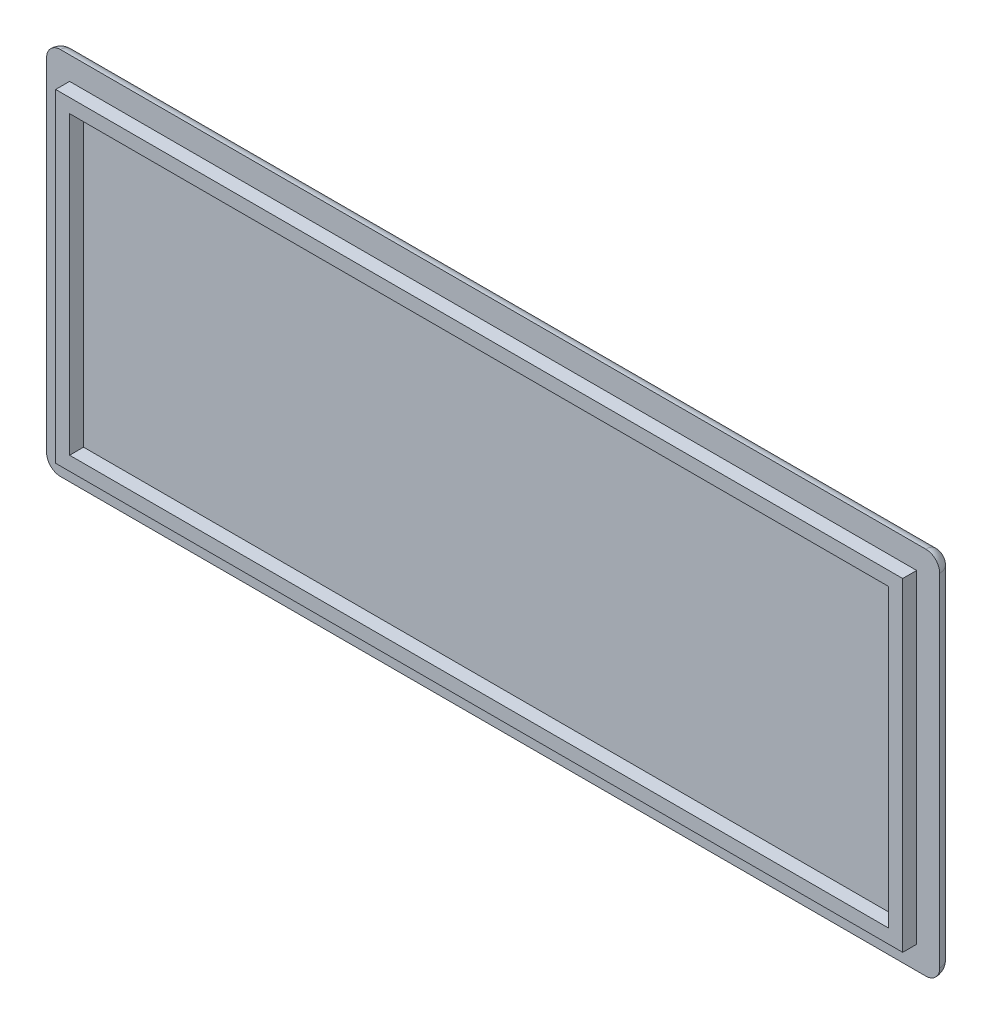
ISO-10303-21;
HEADER;
FILE_DESCRIPTION(('STEP AP214'),'2;1');
FILE_NAME('part.step','',(''),(''),'','','');
FILE_SCHEMA(('AUTOMOTIVE_DESIGN { 1 0 10303 214 1 1 1 1 }'));
ENDSEC;
DATA;
#1=APPLICATION_CONTEXT('core data for automotive mechanical design processes');
#2=APPLICATION_PROTOCOL_DEFINITION('international standard','automotive_design',2000,#1);
#3=PRODUCT_CONTEXT('',#1,'mechanical');
#4=PRODUCT('Part','Part','',(#3));
#5=PRODUCT_RELATED_PRODUCT_CATEGORY('part','',(#4));
#6=PRODUCT_DEFINITION_FORMATION('','',#4);
#7=PRODUCT_DEFINITION_CONTEXT('part definition',#1,'design');
#8=PRODUCT_DEFINITION('design','',#6,#7);
#9=PRODUCT_DEFINITION_SHAPE('','',#8);
#10=(LENGTH_UNIT() NAMED_UNIT(*) SI_UNIT(.MILLI.,.METRE.));
#11=(NAMED_UNIT(*) PLANE_ANGLE_UNIT() SI_UNIT($,.RADIAN.));
#12=(NAMED_UNIT(*) SI_UNIT($,.STERADIAN.) SOLID_ANGLE_UNIT());
#13=UNCERTAINTY_MEASURE_WITH_UNIT(LENGTH_MEASURE(1.E-05),#10,'distance_accuracy_value','');
#14=(GEOMETRIC_REPRESENTATION_CONTEXT(3) GLOBAL_UNCERTAINTY_ASSIGNED_CONTEXT((#13)) GLOBAL_UNIT_ASSIGNED_CONTEXT((#10,
#11,#12)) REPRESENTATION_CONTEXT('',''));
#15=CARTESIAN_POINT('',(0.,0.,0.));
#16=DIRECTION('',(0.,0.,1.));
#17=DIRECTION('',(1.,0.,0.));
#18=AXIS2_PLACEMENT_3D('',#15,#16,#17);
#19=CARTESIAN_POINT('',(1.,25.5,1.));
#20=DIRECTION('',(0.,0.,1.));
#21=DIRECTION('',(1.,0.,0.));
#22=AXIS2_PLACEMENT_3D('',#19,#20,#21);
#23=SPHERICAL_SURFACE('',#22,1.);
#24=CARTESIAN_POINT('',(1.,25.5,1.));
#25=DIRECTION('',(-1.,0.,0.));
#26=DIRECTION('',(0.,0.,1.));
#27=AXIS2_PLACEMENT_3D('',#24,#25,#26);
#28=CIRCLE('',#27,1.);
#29=CARTESIAN_POINT('',(1.,25.5,0.));
#30=VERTEX_POINT('',#29);
#31=CARTESIAN_POINT('',(1.,26.5,1.));
#32=VERTEX_POINT('',#31);
#33=EDGE_CURVE('E250',#30,#32,#28,.F.);
#34=ORIENTED_EDGE('',*,*,#33,.F.);
#35=CARTESIAN_POINT('',(1.,25.5,1.));
#36=DIRECTION('',(0.,-1.,0.));
#37=DIRECTION('',(0.,0.,-1.));
#38=AXIS2_PLACEMENT_3D('',#35,#36,#37);
#39=CIRCLE('',#38,1.);
#40=CARTESIAN_POINT('',(0.,25.5,1.));
#41=VERTEX_POINT('',#40);
#42=EDGE_CURVE('E40',#41,#30,#39,.T.);
#43=ORIENTED_EDGE('',*,*,#42,.F.);
#44=CARTESIAN_POINT('',(1.,25.5,1.));
#45=DIRECTION('',(0.,0.,-1.));
#46=DIRECTION('',(-1.,0.,0.));
#47=AXIS2_PLACEMENT_3D('',#44,#45,#46);
#48=CIRCLE('',#47,1.);
#49=EDGE_CURVE('E11',#32,#41,#48,.F.);
#50=ORIENTED_EDGE('',*,*,#49,.F.);
#51=EDGE_LOOP('',(#34,#43,#50));
#52=FACE_BOUND('',#51,.T.);
#53=ADVANCED_FACE('F33',(#52),#23,.T.);
#54=CARTESIAN_POINT('',(63.,1.,1.));
#55=DIRECTION('',(0.,0.,1.));
#56=DIRECTION('',(1.,0.,0.));
#57=AXIS2_PLACEMENT_3D('',#54,#55,#56);
#58=SPHERICAL_SURFACE('',#57,1.);
#59=CARTESIAN_POINT('',(63.,1.,1.));
#60=DIRECTION('',(0.,1.,0.));
#61=DIRECTION('',(0.,0.,1.));
#62=AXIS2_PLACEMENT_3D('',#59,#60,#61);
#63=CIRCLE('',#62,1.);
#64=CARTESIAN_POINT('',(64.,1.,1.));
#65=VERTEX_POINT('',#64);
#66=CARTESIAN_POINT('',(63.,1.,0.));
#67=VERTEX_POINT('',#66);
#68=EDGE_CURVE('E242',#65,#67,#63,.T.);
#69=ORIENTED_EDGE('',*,*,#68,.F.);
#70=CARTESIAN_POINT('',(63.,1.,1.));
#71=DIRECTION('',(0.,0.,-1.));
#72=DIRECTION('',(-1.,0.,0.));
#73=AXIS2_PLACEMENT_3D('',#70,#71,#72);
#74=CIRCLE('',#73,1.);
#75=CARTESIAN_POINT('',(63.,0.,1.));
#76=VERTEX_POINT('',#75);
#77=EDGE_CURVE('E248',#76,#65,#74,.F.);
#78=ORIENTED_EDGE('',*,*,#77,.F.);
#79=CARTESIAN_POINT('',(63.,1.,1.));
#80=DIRECTION('',(1.,0.,0.));
#81=DIRECTION('',(0.,0.,-1.));
#82=AXIS2_PLACEMENT_3D('',#79,#80,#81);
#83=CIRCLE('',#82,1.);
#84=EDGE_CURVE('E245',#67,#76,#83,.F.);
#85=ORIENTED_EDGE('',*,*,#84,.F.);
#86=EDGE_LOOP('',(#69,#78,#85));
#87=FACE_BOUND('',#86,.T.);
#88=ADVANCED_FACE('F281',(#87),#58,.T.);
#89=CARTESIAN_POINT('',(0.,1.,1.));
#90=DIRECTION('',(1.,0.,0.));
#91=DIRECTION('',(0.,0.,-1.));
#92=AXIS2_PLACEMENT_3D('',#89,#90,#91);
#93=CYLINDRICAL_SURFACE('',#92,1.);
#94=DIRECTION('',(-1.,0.,0.));
#95=VECTOR('',#94,1.);
#96=CARTESIAN_POINT('',(0.,1.,0.));
#97=LINE('',#96,#95);
#98=CARTESIAN_POINT('',(1.,1.,0.));
#99=VERTEX_POINT('',#98);
#100=EDGE_CURVE('E228',#67,#99,#97,.T.);
#101=ORIENTED_EDGE('',*,*,#100,.F.);
#102=ORIENTED_EDGE('',*,*,#84,.T.);
#103=DIRECTION('',(1.,0.,0.));
#104=VECTOR('',#103,1.);
#105=CARTESIAN_POINT('',(0.,0.,1.));
#106=LINE('',#105,#104);
#107=CARTESIAN_POINT('',(1.,0.,1.));
#108=VERTEX_POINT('',#107);
#109=EDGE_CURVE('E207',#108,#76,#106,.T.);
#110=ORIENTED_EDGE('',*,*,#109,.F.);
#111=CARTESIAN_POINT('',(1.,1.,1.));
#112=DIRECTION('',(-1.,0.,0.));
#113=DIRECTION('',(0.,0.,1.));
#114=AXIS2_PLACEMENT_3D('',#111,#112,#113);
#115=CIRCLE('',#114,1.);
#116=EDGE_CURVE('E240',#99,#108,#115,.T.);
#117=ORIENTED_EDGE('',*,*,#116,.F.);
#118=EDGE_LOOP('',(#101,#102,#110,#117));
#119=FACE_BOUND('',#118,.T.);
#120=ADVANCED_FACE('F272',(#119),#93,.T.);
#121=CARTESIAN_POINT('',(63.,0.,1.));
#122=DIRECTION('',(0.,1.,0.));
#123=DIRECTION('',(0.,0.,1.));
#124=AXIS2_PLACEMENT_3D('',#121,#122,#123);
#125=CYLINDRICAL_SURFACE('',#124,1.);
#126=DIRECTION('',(0.,1.,0.));
#127=VECTOR('',#126,1.);
#128=CARTESIAN_POINT('',(64.,0.,1.));
#129=LINE('',#128,#127);
#130=CARTESIAN_POINT('',(64.,25.5,1.));
#131=VERTEX_POINT('',#130);
#132=EDGE_CURVE('E210',#65,#131,#129,.T.);
#133=ORIENTED_EDGE('',*,*,#132,.F.);
#134=ORIENTED_EDGE('',*,*,#68,.T.);
#135=DIRECTION('',(0.,-1.,0.));
#136=VECTOR('',#135,1.);
#137=CARTESIAN_POINT('',(63.,0.,0.));
#138=LINE('',#137,#136);
#139=CARTESIAN_POINT('',(63.,25.5,0.));
#140=VERTEX_POINT('',#139);
#141=EDGE_CURVE('E231',#140,#67,#138,.T.);
#142=ORIENTED_EDGE('',*,*,#141,.F.);
#143=CARTESIAN_POINT('',(63.,25.5,1.));
#144=DIRECTION('',(0.,-1.,0.));
#145=DIRECTION('',(0.,0.,-1.));
#146=AXIS2_PLACEMENT_3D('',#143,#144,#145);
#147=CIRCLE('',#146,1.);
#148=EDGE_CURVE('E237',#140,#131,#147,.T.);
#149=ORIENTED_EDGE('',*,*,#148,.T.);
#150=EDGE_LOOP('',(#133,#134,#142,#149));
#151=FACE_BOUND('',#150,.T.);
#152=ADVANCED_FACE('F269',(#151),#125,.T.);
#153=CARTESIAN_POINT('',(63.,25.5,1.));
#154=DIRECTION('',(0.,0.,1.));
#155=DIRECTION('',(1.,0.,0.));
#156=AXIS2_PLACEMENT_3D('',#153,#154,#155);
#157=SPHERICAL_SURFACE('',#156,1.);
#158=ORIENTED_EDGE('',*,*,#148,.F.);
#159=CARTESIAN_POINT('',(63.,25.5,1.));
#160=DIRECTION('',(-1.,0.,0.));
#161=DIRECTION('',(0.,0.,1.));
#162=AXIS2_PLACEMENT_3D('',#159,#160,#161);
#163=CIRCLE('',#162,1.);
#164=CARTESIAN_POINT('',(63.,26.5,1.));
#165=VERTEX_POINT('',#164);
#166=EDGE_CURVE('E220',#165,#140,#163,.T.);
#167=ORIENTED_EDGE('',*,*,#166,.F.);
#168=CARTESIAN_POINT('',(63.,25.5,1.));
#169=DIRECTION('',(0.,0.,-1.));
#170=DIRECTION('',(-1.,0.,0.));
#171=AXIS2_PLACEMENT_3D('',#168,#169,#170);
#172=CIRCLE('',#171,1.);
#173=EDGE_CURVE('E226',#131,#165,#172,.F.);
#174=ORIENTED_EDGE('',*,*,#173,.F.);
#175=EDGE_LOOP('',(#158,#167,#174));
#176=FACE_BOUND('',#175,.T.);
#177=ADVANCED_FACE('F265',(#176),#157,.T.);
#178=CARTESIAN_POINT('',(1.,1.,1.));
#179=DIRECTION('',(0.,0.,1.));
#180=DIRECTION('',(1.,0.,0.));
#181=AXIS2_PLACEMENT_3D('',#178,#179,#180);
#182=SPHERICAL_SURFACE('',#181,1.);
#183=CARTESIAN_POINT('',(1.,1.,1.));
#184=DIRECTION('',(0.,-1.,0.));
#185=DIRECTION('',(0.,0.,-1.));
#186=AXIS2_PLACEMENT_3D('',#183,#184,#185);
#187=CIRCLE('',#186,1.);
#188=CARTESIAN_POINT('',(0.,1.,1.));
#189=VERTEX_POINT('',#188);
#190=EDGE_CURVE('E234',#99,#189,#187,.F.);
#191=ORIENTED_EDGE('',*,*,#190,.F.);
#192=ORIENTED_EDGE('',*,*,#116,.T.);
#193=CARTESIAN_POINT('',(1.,1.,1.));
#194=DIRECTION('',(0.,0.,-1.));
#195=DIRECTION('',(-1.,0.,0.));
#196=AXIS2_PLACEMENT_3D('',#193,#194,#195);
#197=CIRCLE('',#196,1.);
#198=EDGE_CURVE('E223',#189,#108,#197,.F.);
#199=ORIENTED_EDGE('',*,*,#198,.F.);
#200=EDGE_LOOP('',(#191,#192,#199));
#201=FACE_BOUND('',#200,.T.);
#202=ADVANCED_FACE('F277',(#201),#182,.T.);
#203=CARTESIAN_POINT('',(1.,0.,1.));
#204=DIRECTION('',(0.,-1.,0.));
#205=DIRECTION('',(0.,0.,-1.));
#206=AXIS2_PLACEMENT_3D('',#203,#204,#205);
#207=CYLINDRICAL_SURFACE('',#206,1.);
#208=DIRECTION('',(0.,-1.,0.));
#209=VECTOR('',#208,1.);
#210=CARTESIAN_POINT('',(0.,0.,1.));
#211=LINE('',#210,#209);
#212=EDGE_CURVE('E205',#41,#189,#211,.T.);
#213=ORIENTED_EDGE('',*,*,#212,.F.);
#214=ORIENTED_EDGE('',*,*,#42,.T.);
#215=DIRECTION('',(0.,1.,0.));
#216=VECTOR('',#215,1.);
#217=CARTESIAN_POINT('',(1.,0.,0.));
#218=LINE('',#217,#216);
#219=EDGE_CURVE('E217',#99,#30,#218,.T.);
#220=ORIENTED_EDGE('',*,*,#219,.F.);
#221=ORIENTED_EDGE('',*,*,#190,.T.);
#222=EDGE_LOOP('',(#213,#214,#220,#221));
#223=FACE_BOUND('',#222,.T.);
#224=ADVANCED_FACE('F254',(#223),#207,.T.);
#225=CARTESIAN_POINT('',(0.,25.5,1.));
#226=DIRECTION('',(-1.,0.,0.));
#227=DIRECTION('',(0.,0.,1.));
#228=AXIS2_PLACEMENT_3D('',#225,#226,#227);
#229=CYLINDRICAL_SURFACE('',#228,1.);
#230=DIRECTION('',(1.,0.,0.));
#231=VECTOR('',#230,1.);
#232=CARTESIAN_POINT('',(0.,25.5,0.));
#233=LINE('',#232,#231);
#234=EDGE_CURVE('E214',#30,#140,#233,.T.);
#235=ORIENTED_EDGE('',*,*,#234,.F.);
#236=ORIENTED_EDGE('',*,*,#33,.T.);
#237=DIRECTION('',(-1.,0.,0.));
#238=VECTOR('',#237,1.);
#239=CARTESIAN_POINT('',(0.,26.5,1.));
#240=LINE('',#239,#238);
#241=EDGE_CURVE('E212',#165,#32,#240,.T.);
#242=ORIENTED_EDGE('',*,*,#241,.F.);
#243=ORIENTED_EDGE('',*,*,#166,.T.);
#244=EDGE_LOOP('',(#235,#236,#242,#243));
#245=FACE_BOUND('',#244,.T.);
#246=ADVANCED_FACE('F261',(#245),#229,.T.);
#247=CARTESIAN_POINT('',(0.,0.,1.));
#248=DIRECTION('',(0.,0.,-1.));
#249=DIRECTION('',(-1.,0.,0.));
#250=AXIS2_PLACEMENT_3D('',#247,#248,#249);
#251=PLANE('',#250);
#252=ORIENTED_EDGE('',*,*,#241,.T.);
#253=ORIENTED_EDGE('',*,*,#49,.T.);
#254=ORIENTED_EDGE('',*,*,#212,.T.);
#255=ORIENTED_EDGE('',*,*,#198,.T.);
#256=ORIENTED_EDGE('',*,*,#109,.T.);
#257=ORIENTED_EDGE('',*,*,#77,.T.);
#258=ORIENTED_EDGE('',*,*,#132,.T.);
#259=ORIENTED_EDGE('',*,*,#173,.T.);
#260=EDGE_LOOP('',(#252,#253,#254,#255,#256,#257,#258,#259));
#261=FACE_BOUND('',#260,.T.);
#262=DIRECTION('',(0.,-1.,0.));
#263=VECTOR('',#262,1.);
#264=CARTESIAN_POINT('',(1.65,1.65,1.));
#265=LINE('',#264,#263);
#266=CARTESIAN_POINT('',(1.65,24.85,1.));
#267=VERTEX_POINT('',#266);
#268=CARTESIAN_POINT('',(1.65,1.65,1.));
#269=VERTEX_POINT('',#268);
#270=EDGE_CURVE('E169',#267,#269,#265,.T.);
#271=ORIENTED_EDGE('',*,*,#270,.F.);
#272=DIRECTION('',(-1.,0.,0.));
#273=VECTOR('',#272,1.);
#274=CARTESIAN_POINT('',(1.65,24.85,1.));
#275=LINE('',#274,#273);
#276=CARTESIAN_POINT('',(62.35,24.85,1.));
#277=VERTEX_POINT('',#276);
#278=EDGE_CURVE('E177',#277,#267,#275,.T.);
#279=ORIENTED_EDGE('',*,*,#278,.F.);
#280=DIRECTION('',(0.,1.,0.));
#281=VECTOR('',#280,1.);
#282=CARTESIAN_POINT('',(62.35,1.65,1.));
#283=LINE('',#282,#281);
#284=CARTESIAN_POINT('',(62.35,1.65,1.));
#285=VERTEX_POINT('',#284);
#286=EDGE_CURVE('E189',#285,#277,#283,.T.);
#287=ORIENTED_EDGE('',*,*,#286,.F.);
#288=DIRECTION('',(1.,0.,0.));
#289=VECTOR('',#288,1.);
#290=CARTESIAN_POINT('',(1.65,1.65,1.));
#291=LINE('',#290,#289);
#292=EDGE_CURVE('E186',#269,#285,#291,.T.);
#293=ORIENTED_EDGE('',*,*,#292,.F.);
#294=EDGE_LOOP('',(#271,#279,#287,#293));
#295=FACE_BOUND('',#294,.T.);
#296=ADVANCED_FACE('F278',(#261,#295),#251,.F.);
#297=CARTESIAN_POINT('',(0.,0.,0.));
#298=DIRECTION('',(0.,0.,-1.));
#299=DIRECTION('',(-1.,0.,0.));
#300=AXIS2_PLACEMENT_3D('',#297,#298,#299);
#301=PLANE('',#300);
#302=ORIENTED_EDGE('',*,*,#234,.T.);
#303=ORIENTED_EDGE('',*,*,#141,.T.);
#304=ORIENTED_EDGE('',*,*,#100,.T.);
#305=ORIENTED_EDGE('',*,*,#219,.T.);
#306=EDGE_LOOP('',(#302,#303,#304,#305));
#307=FACE_BOUND('',#306,.T.);
#308=ADVANCED_FACE('F259',(#307),#301,.T.);
#309=CARTESIAN_POINT('',(1.65,1.65,2.));
#310=DIRECTION('',(1.,0.,0.));
#311=DIRECTION('',(0.,0.,-1.));
#312=AXIS2_PLACEMENT_3D('',#309,#310,#311);
#313=PLANE('',#312);
#314=ORIENTED_EDGE('',*,*,#270,.T.);
#315=DIRECTION('',(0.,0.,-1.));
#316=VECTOR('',#315,1.);
#317=CARTESIAN_POINT('',(1.65,1.65,2.));
#318=LINE('',#317,#316);
#319=CARTESIAN_POINT('',(1.65,1.65,2.));
#320=VERTEX_POINT('',#319);
#321=EDGE_CURVE('E202',#320,#269,#318,.T.);
#322=ORIENTED_EDGE('',*,*,#321,.F.);
#323=DIRECTION('',(0.,-1.,0.));
#324=VECTOR('',#323,1.);
#325=CARTESIAN_POINT('',(1.65,1.65,2.));
#326=LINE('',#325,#324);
#327=CARTESIAN_POINT('',(1.65,24.85,2.));
#328=VERTEX_POINT('',#327);
#329=EDGE_CURVE('E173',#328,#320,#326,.T.);
#330=ORIENTED_EDGE('',*,*,#329,.F.);
#331=DIRECTION('',(0.,0.,-1.));
#332=VECTOR('',#331,1.);
#333=CARTESIAN_POINT('',(1.65,24.85,2.));
#334=LINE('',#333,#332);
#335=EDGE_CURVE('E183',#328,#267,#334,.T.);
#336=ORIENTED_EDGE('',*,*,#335,.T.);
#337=EDGE_LOOP('',(#314,#322,#330,#336));
#338=FACE_BOUND('',#337,.T.);
#339=ADVANCED_FACE('F301',(#338),#313,.F.);
#340=CARTESIAN_POINT('',(1.65,1.65,2.));
#341=DIRECTION('',(0.,1.,0.));
#342=DIRECTION('',(0.,0.,1.));
#343=AXIS2_PLACEMENT_3D('',#340,#341,#342);
#344=PLANE('',#343);
#345=ORIENTED_EDGE('',*,*,#292,.T.);
#346=DIRECTION('',(0.,0.,-1.));
#347=VECTOR('',#346,1.);
#348=CARTESIAN_POINT('',(62.35,1.65,2.));
#349=LINE('',#348,#347);
#350=CARTESIAN_POINT('',(62.35,1.65,2.));
#351=VERTEX_POINT('',#350);
#352=EDGE_CURVE('E199',#351,#285,#349,.T.);
#353=ORIENTED_EDGE('',*,*,#352,.F.);
#354=DIRECTION('',(1.,0.,0.));
#355=VECTOR('',#354,1.);
#356=CARTESIAN_POINT('',(1.65,1.65,2.));
#357=LINE('',#356,#355);
#358=EDGE_CURVE('E176',#320,#351,#357,.T.);
#359=ORIENTED_EDGE('',*,*,#358,.F.);
#360=ORIENTED_EDGE('',*,*,#321,.T.);
#361=EDGE_LOOP('',(#345,#353,#359,#360));
#362=FACE_BOUND('',#361,.T.);
#363=ADVANCED_FACE('F306',(#362),#344,.F.);
#364=CARTESIAN_POINT('',(62.35,1.65,2.));
#365=DIRECTION('',(-1.,0.,0.));
#366=DIRECTION('',(0.,0.,1.));
#367=AXIS2_PLACEMENT_3D('',#364,#365,#366);
#368=PLANE('',#367);
#369=ORIENTED_EDGE('',*,*,#286,.T.);
#370=DIRECTION('',(0.,0.,-1.));
#371=VECTOR('',#370,1.);
#372=CARTESIAN_POINT('',(62.35,24.85,2.));
#373=LINE('',#372,#371);
#374=CARTESIAN_POINT('',(62.35,24.85,2.));
#375=VERTEX_POINT('',#374);
#376=EDGE_CURVE('E196',#375,#277,#373,.T.);
#377=ORIENTED_EDGE('',*,*,#376,.F.);
#378=DIRECTION('',(0.,1.,0.));
#379=VECTOR('',#378,1.);
#380=CARTESIAN_POINT('',(62.35,1.65,2.));
#381=LINE('',#380,#379);
#382=EDGE_CURVE('E179',#351,#375,#381,.T.);
#383=ORIENTED_EDGE('',*,*,#382,.F.);
#384=ORIENTED_EDGE('',*,*,#352,.T.);
#385=EDGE_LOOP('',(#369,#377,#383,#384));
#386=FACE_BOUND('',#385,.T.);
#387=ADVANCED_FACE('F310',(#386),#368,.F.);
#388=CARTESIAN_POINT('',(1.65,24.85,2.));
#389=DIRECTION('',(0.,-1.,0.));
#390=DIRECTION('',(0.,0.,-1.));
#391=AXIS2_PLACEMENT_3D('',#388,#389,#390);
#392=PLANE('',#391);
#393=ORIENTED_EDGE('',*,*,#278,.T.);
#394=ORIENTED_EDGE('',*,*,#335,.F.);
#395=DIRECTION('',(-1.,0.,0.));
#396=VECTOR('',#395,1.);
#397=CARTESIAN_POINT('',(1.65,24.85,2.));
#398=LINE('',#397,#396);
#399=EDGE_CURVE('E181',#375,#328,#398,.T.);
#400=ORIENTED_EDGE('',*,*,#399,.F.);
#401=ORIENTED_EDGE('',*,*,#376,.T.);
#402=EDGE_LOOP('',(#393,#394,#400,#401));
#403=FACE_BOUND('',#402,.T.);
#404=ADVANCED_FACE('F314',(#403),#392,.F.);
#405=CARTESIAN_POINT('',(0.,0.,2.));
#406=DIRECTION('',(0.,0.,-1.));
#407=DIRECTION('',(-1.,0.,0.));
#408=AXIS2_PLACEMENT_3D('',#405,#406,#407);
#409=PLANE('',#408);
#410=DIRECTION('',(1.,0.,0.));
#411=VECTOR('',#410,1.);
#412=CARTESIAN_POINT('',(2.65,2.65,2.));
#413=LINE('',#412,#411);
#414=CARTESIAN_POINT('',(2.65,2.65,2.));
#415=VERTEX_POINT('',#414);
#416=CARTESIAN_POINT('',(61.35,2.65,2.));
#417=VERTEX_POINT('',#416);
#418=EDGE_CURVE('E163',#415,#417,#413,.T.);
#419=ORIENTED_EDGE('',*,*,#418,.F.);
#420=DIRECTION('',(0.,-1.,0.));
#421=VECTOR('',#420,1.);
#422=CARTESIAN_POINT('',(2.65,2.65,2.));
#423=LINE('',#422,#421);
#424=CARTESIAN_POINT('',(2.65,23.85,2.));
#425=VERTEX_POINT('',#424);
#426=EDGE_CURVE('E137',#425,#415,#423,.T.);
#427=ORIENTED_EDGE('',*,*,#426,.F.);
#428=DIRECTION('',(-1.,0.,0.));
#429=VECTOR('',#428,1.);
#430=CARTESIAN_POINT('',(2.65,23.85,2.));
#431=LINE('',#430,#429);
#432=CARTESIAN_POINT('',(61.35,23.85,2.));
#433=VERTEX_POINT('',#432);
#434=EDGE_CURVE('E154',#433,#425,#431,.T.);
#435=ORIENTED_EDGE('',*,*,#434,.F.);
#436=DIRECTION('',(0.,1.,0.));
#437=VECTOR('',#436,1.);
#438=CARTESIAN_POINT('',(61.35,2.65,2.));
#439=LINE('',#438,#437);
#440=EDGE_CURVE('E157',#417,#433,#439,.T.);
#441=ORIENTED_EDGE('',*,*,#440,.F.);
#442=EDGE_LOOP('',(#419,#427,#435,#441));
#443=FACE_BOUND('',#442,.T.);
#444=ORIENTED_EDGE('',*,*,#329,.T.);
#445=ORIENTED_EDGE('',*,*,#358,.T.);
#446=ORIENTED_EDGE('',*,*,#382,.T.);
#447=ORIENTED_EDGE('',*,*,#399,.T.);
#448=EDGE_LOOP('',(#444,#445,#446,#447));
#449=FACE_BOUND('',#448,.T.);
#450=ADVANCED_FACE('F318',(#443,#449),#409,.F.);
#451=CARTESIAN_POINT('',(2.65,2.65,1.));
#452=DIRECTION('',(-1.,0.,0.));
#453=DIRECTION('',(0.,0.,1.));
#454=AXIS2_PLACEMENT_3D('',#451,#452,#453);
#455=PLANE('',#454);
#456=ORIENTED_EDGE('',*,*,#426,.T.);
#457=DIRECTION('',(0.,0.,1.));
#458=VECTOR('',#457,1.);
#459=CARTESIAN_POINT('',(2.65,2.65,1.));
#460=LINE('',#459,#458);
#461=CARTESIAN_POINT('',(2.65,2.65,1.));
#462=VERTEX_POINT('',#461);
#463=EDGE_CURVE('E130',#462,#415,#460,.T.);
#464=ORIENTED_EDGE('',*,*,#463,.F.);
#465=DIRECTION('',(0.,-1.,0.));
#466=VECTOR('',#465,1.);
#467=CARTESIAN_POINT('',(2.65,2.65,1.));
#468=LINE('',#467,#466);
#469=CARTESIAN_POINT('',(2.65,23.85,1.));
#470=VERTEX_POINT('',#469);
#471=EDGE_CURVE('E134',#470,#462,#468,.T.);
#472=ORIENTED_EDGE('',*,*,#471,.F.);
#473=DIRECTION('',(0.,0.,1.));
#474=VECTOR('',#473,1.);
#475=CARTESIAN_POINT('',(2.65,23.85,1.));
#476=LINE('',#475,#474);
#477=EDGE_CURVE('E167',#470,#425,#476,.T.);
#478=ORIENTED_EDGE('',*,*,#477,.T.);
#479=EDGE_LOOP('',(#456,#464,#472,#478));
#480=FACE_BOUND('',#479,.T.);
#481=ADVANCED_FACE('F132',(#480),#455,.F.);
#482=CARTESIAN_POINT('',(2.65,23.85,1.));
#483=DIRECTION('',(0.,1.,0.));
#484=DIRECTION('',(0.,0.,1.));
#485=AXIS2_PLACEMENT_3D('',#482,#483,#484);
#486=PLANE('',#485);
#487=ORIENTED_EDGE('',*,*,#434,.T.);
#488=ORIENTED_EDGE('',*,*,#477,.F.);
#489=DIRECTION('',(-1.,0.,0.));
#490=VECTOR('',#489,1.);
#491=CARTESIAN_POINT('',(2.65,23.85,1.));
#492=LINE('',#491,#490);
#493=CARTESIAN_POINT('',(61.35,23.85,1.));
#494=VERTEX_POINT('',#493);
#495=EDGE_CURVE('E142',#494,#470,#492,.T.);
#496=ORIENTED_EDGE('',*,*,#495,.F.);
#497=DIRECTION('',(0.,0.,1.));
#498=VECTOR('',#497,1.);
#499=CARTESIAN_POINT('',(61.35,23.85,1.));
#500=LINE('',#499,#498);
#501=EDGE_CURVE('E170',#494,#433,#500,.T.);
#502=ORIENTED_EDGE('',*,*,#501,.T.);
#503=EDGE_LOOP('',(#487,#488,#496,#502));
#504=FACE_BOUND('',#503,.T.);
#505=ADVANCED_FACE('F325',(#504),#486,.F.);
#506=CARTESIAN_POINT('',(61.35,2.65,1.));
#507=DIRECTION('',(1.,0.,0.));
#508=DIRECTION('',(0.,0.,-1.));
#509=AXIS2_PLACEMENT_3D('',#506,#507,#508);
#510=PLANE('',#509);
#511=ORIENTED_EDGE('',*,*,#440,.T.);
#512=ORIENTED_EDGE('',*,*,#501,.F.);
#513=DIRECTION('',(0.,1.,0.));
#514=VECTOR('',#513,1.);
#515=CARTESIAN_POINT('',(61.35,2.65,1.));
#516=LINE('',#515,#514);
#517=CARTESIAN_POINT('',(61.35,2.65,1.));
#518=VERTEX_POINT('',#517);
#519=EDGE_CURVE('E150',#518,#494,#516,.T.);
#520=ORIENTED_EDGE('',*,*,#519,.F.);
#521=DIRECTION('',(0.,0.,1.));
#522=VECTOR('',#521,1.);
#523=CARTESIAN_POINT('',(61.35,2.65,1.));
#524=LINE('',#523,#522);
#525=EDGE_CURVE('E141',#518,#417,#524,.T.);
#526=ORIENTED_EDGE('',*,*,#525,.T.);
#527=EDGE_LOOP('',(#511,#512,#520,#526));
#528=FACE_BOUND('',#527,.T.);
#529=ADVANCED_FACE('F328',(#528),#510,.F.);
#530=CARTESIAN_POINT('',(2.65,2.65,1.));
#531=DIRECTION('',(0.,-1.,0.));
#532=DIRECTION('',(0.,0.,-1.));
#533=AXIS2_PLACEMENT_3D('',#530,#531,#532);
#534=PLANE('',#533);
#535=ORIENTED_EDGE('',*,*,#418,.T.);
#536=ORIENTED_EDGE('',*,*,#525,.F.);
#537=DIRECTION('',(1.,0.,0.));
#538=VECTOR('',#537,1.);
#539=CARTESIAN_POINT('',(2.65,2.65,1.));
#540=LINE('',#539,#538);
#541=EDGE_CURVE('E145',#462,#518,#540,.T.);
#542=ORIENTED_EDGE('',*,*,#541,.F.);
#543=ORIENTED_EDGE('',*,*,#463,.T.);
#544=EDGE_LOOP('',(#535,#536,#542,#543));
#545=FACE_BOUND('',#544,.T.);
#546=ADVANCED_FACE('F146',(#545),#534,.F.);
#547=CARTESIAN_POINT('',(0.,0.,1.));
#548=DIRECTION('',(0.,0.,-1.));
#549=DIRECTION('',(-1.,0.,0.));
#550=AXIS2_PLACEMENT_3D('',#547,#548,#549);
#551=PLANE('',#550);
#552=ORIENTED_EDGE('',*,*,#471,.T.);
#553=ORIENTED_EDGE('',*,*,#541,.T.);
#554=ORIENTED_EDGE('',*,*,#519,.T.);
#555=ORIENTED_EDGE('',*,*,#495,.T.);
#556=EDGE_LOOP('',(#552,#553,#554,#555));
#557=FACE_BOUND('',#556,.T.);
#558=ADVANCED_FACE('F152',(#557),#551,.F.);
#559=CLOSED_SHELL('',(#53,#88,#120,#152,#177,#202,#224,#246,#296,#308,#339,#363,#387,#404,#450,
#481,#505,#529,#546,#558));
#560=MANIFOLD_SOLID_BREP('B2',#559);
#561=ADVANCED_BREP_SHAPE_REPRESENTATION('',(#18,#560),#14);
#562=SHAPE_DEFINITION_REPRESENTATION(#9,#561);
ENDSEC;
END-ISO-10303-21;
